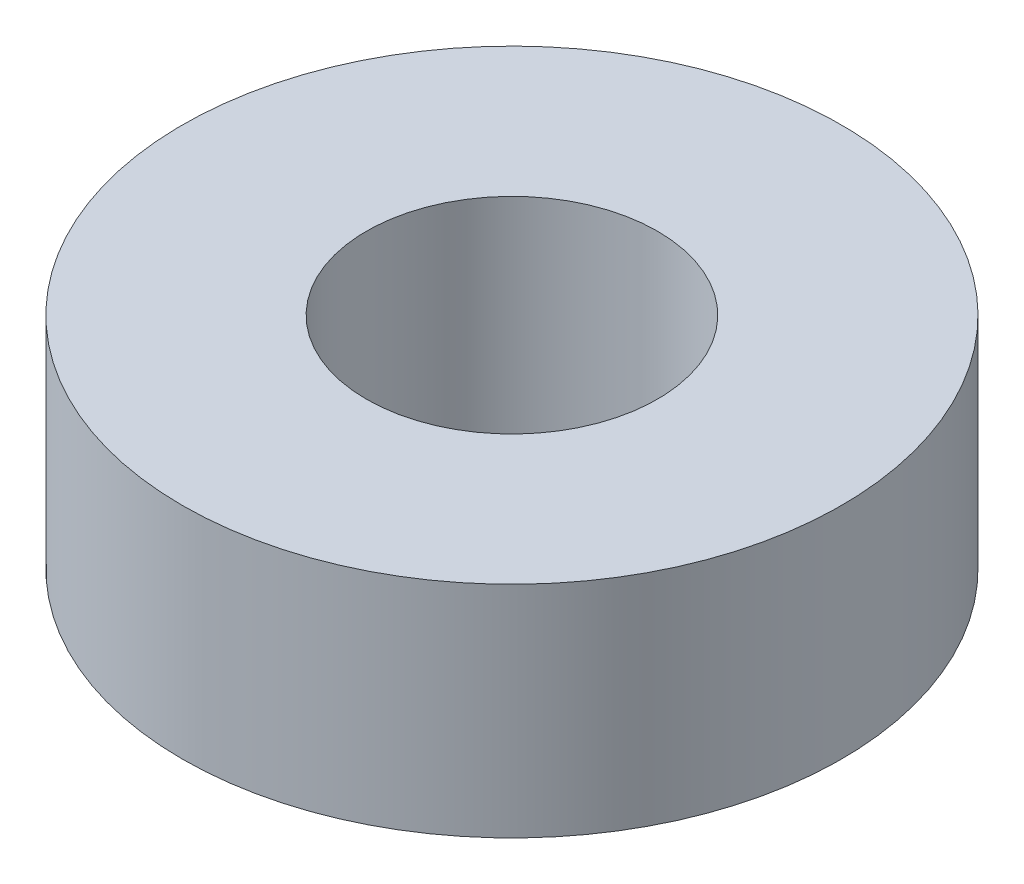
ISO-10303-21;
HEADER;
FILE_DESCRIPTION(('STEP AP214'),'2;1');
FILE_NAME('part.step','',(''),(''),'','','');
FILE_SCHEMA(('AUTOMOTIVE_DESIGN { 1 0 10303 214 1 1 1 1 }'));
ENDSEC;
DATA;
#1=APPLICATION_CONTEXT('core data for automotive mechanical design processes');
#2=APPLICATION_PROTOCOL_DEFINITION('international standard','automotive_design',2000,#1);
#3=PRODUCT_CONTEXT('',#1,'mechanical');
#4=PRODUCT('Part','Part','',(#3));
#5=PRODUCT_RELATED_PRODUCT_CATEGORY('part','',(#4));
#6=PRODUCT_DEFINITION_FORMATION('','',#4);
#7=PRODUCT_DEFINITION_CONTEXT('part definition',#1,'design');
#8=PRODUCT_DEFINITION('design','',#6,#7);
#9=PRODUCT_DEFINITION_SHAPE('','',#8);
#10=(LENGTH_UNIT() NAMED_UNIT(*) SI_UNIT(.MILLI.,.METRE.));
#11=(NAMED_UNIT(*) PLANE_ANGLE_UNIT() SI_UNIT($,.RADIAN.));
#12=(NAMED_UNIT(*) SI_UNIT($,.STERADIAN.) SOLID_ANGLE_UNIT());
#13=UNCERTAINTY_MEASURE_WITH_UNIT(LENGTH_MEASURE(1.E-05),#10,'distance_accuracy_value','');
#14=(GEOMETRIC_REPRESENTATION_CONTEXT(3) GLOBAL_UNCERTAINTY_ASSIGNED_CONTEXT((#13)) GLOBAL_UNIT_ASSIGNED_CONTEXT((#10,
#11,#12)) REPRESENTATION_CONTEXT('',''));
#15=CARTESIAN_POINT('',(0.,0.,0.));
#16=DIRECTION('',(0.,0.,1.));
#17=DIRECTION('',(1.,0.,0.));
#18=AXIS2_PLACEMENT_3D('',#15,#16,#17);
#19=CARTESIAN_POINT('',(0.,4.,0.));
#20=DIRECTION('',(0.,1.,0.));
#21=DIRECTION('',(0.,0.,1.));
#22=AXIS2_PLACEMENT_3D('',#19,#20,#21);
#23=PLANE('',#22);
#24=CARTESIAN_POINT('',(0.,4.,0.));
#25=DIRECTION('',(0.,1.,0.));
#26=DIRECTION('',(0.,0.,1.));
#27=AXIS2_PLACEMENT_3D('',#24,#25,#26);
#28=CIRCLE('',#27,6.);
#29=CARTESIAN_POINT('',(0.,4.,6.));
#30=VERTEX_POINT('',#29);
#31=EDGE_CURVE('E10',#30,#30,#28,.T.);
#32=ORIENTED_EDGE('',*,*,#31,.T.);
#33=EDGE_LOOP('',(#32));
#34=FACE_BOUND('',#33,.T.);
#35=CARTESIAN_POINT('',(0.,4.,0.));
#36=DIRECTION('',(0.,1.,0.));
#37=DIRECTION('',(0.,0.,1.));
#38=AXIS2_PLACEMENT_3D('',#35,#36,#37);
#39=CIRCLE('',#38,2.65);
#40=CARTESIAN_POINT('',(0.,4.,2.65));
#41=VERTEX_POINT('',#40);
#42=EDGE_CURVE('E43',#41,#41,#39,.T.);
#43=ORIENTED_EDGE('',*,*,#42,.F.);
#44=EDGE_LOOP('',(#43));
#45=FACE_BOUND('',#44,.T.);
#46=ADVANCED_FACE('F32',(#34,#45),#23,.T.);
#47=CARTESIAN_POINT('',(0.,0.,0.));
#48=DIRECTION('',(0.,1.,0.));
#49=DIRECTION('',(0.,0.,1.));
#50=AXIS2_PLACEMENT_3D('',#47,#48,#49);
#51=PLANE('',#50);
#52=CARTESIAN_POINT('',(0.,0.,0.));
#53=DIRECTION('',(0.,1.,0.));
#54=DIRECTION('',(0.,0.,1.));
#55=AXIS2_PLACEMENT_3D('',#52,#53,#54);
#56=CIRCLE('',#55,6.);
#57=CARTESIAN_POINT('',(0.,0.,6.));
#58=VERTEX_POINT('',#57);
#59=EDGE_CURVE('E36',#58,#58,#56,.T.);
#60=ORIENTED_EDGE('',*,*,#59,.F.);
#61=EDGE_LOOP('',(#60));
#62=FACE_BOUND('',#61,.T.);
#63=CARTESIAN_POINT('',(0.,0.,0.));
#64=DIRECTION('',(0.,1.,0.));
#65=DIRECTION('',(0.,0.,1.));
#66=AXIS2_PLACEMENT_3D('',#63,#64,#65);
#67=CIRCLE('',#66,2.65);
#68=CARTESIAN_POINT('',(0.,0.,2.65));
#69=VERTEX_POINT('',#68);
#70=EDGE_CURVE('E45',#69,#69,#67,.T.);
#71=ORIENTED_EDGE('',*,*,#70,.T.);
#72=EDGE_LOOP('',(#71));
#73=FACE_BOUND('',#72,.T.);
#74=ADVANCED_FACE('F55',(#62,#73),#51,.F.);
#75=CARTESIAN_POINT('',(0.,4.,0.));
#76=DIRECTION('',(0.,-1.,0.));
#77=DIRECTION('',(0.,0.,-1.));
#78=AXIS2_PLACEMENT_3D('',#75,#76,#77);
#79=CYLINDRICAL_SURFACE('',#78,6.);
#80=ORIENTED_EDGE('',*,*,#31,.F.);
#81=EDGE_LOOP('',(#80));
#82=FACE_BOUND('',#81,.T.);
#83=ORIENTED_EDGE('',*,*,#59,.T.);
#84=EDGE_LOOP('',(#83));
#85=FACE_BOUND('',#84,.T.);
#86=ADVANCED_FACE('F34',(#82,#85),#79,.T.);
#87=CARTESIAN_POINT('',(0.,4.,0.));
#88=DIRECTION('',(0.,-1.,0.));
#89=DIRECTION('',(0.,0.,-1.));
#90=AXIS2_PLACEMENT_3D('',#87,#88,#89);
#91=CYLINDRICAL_SURFACE('',#90,2.65);
#92=ORIENTED_EDGE('',*,*,#42,.T.);
#93=EDGE_LOOP('',(#92));
#94=FACE_BOUND('',#93,.T.);
#95=ORIENTED_EDGE('',*,*,#70,.F.);
#96=EDGE_LOOP('',(#95));
#97=FACE_BOUND('',#96,.T.);
#98=ADVANCED_FACE('F51',(#94,#97),#91,.F.);
#99=CLOSED_SHELL('',(#46,#74,#86,#98));
#100=MANIFOLD_SOLID_BREP('B2',#99);
#101=ADVANCED_BREP_SHAPE_REPRESENTATION('',(#18,#100),#14);
#102=SHAPE_DEFINITION_REPRESENTATION(#9,#101);
ENDSEC;
END-ISO-10303-21;
